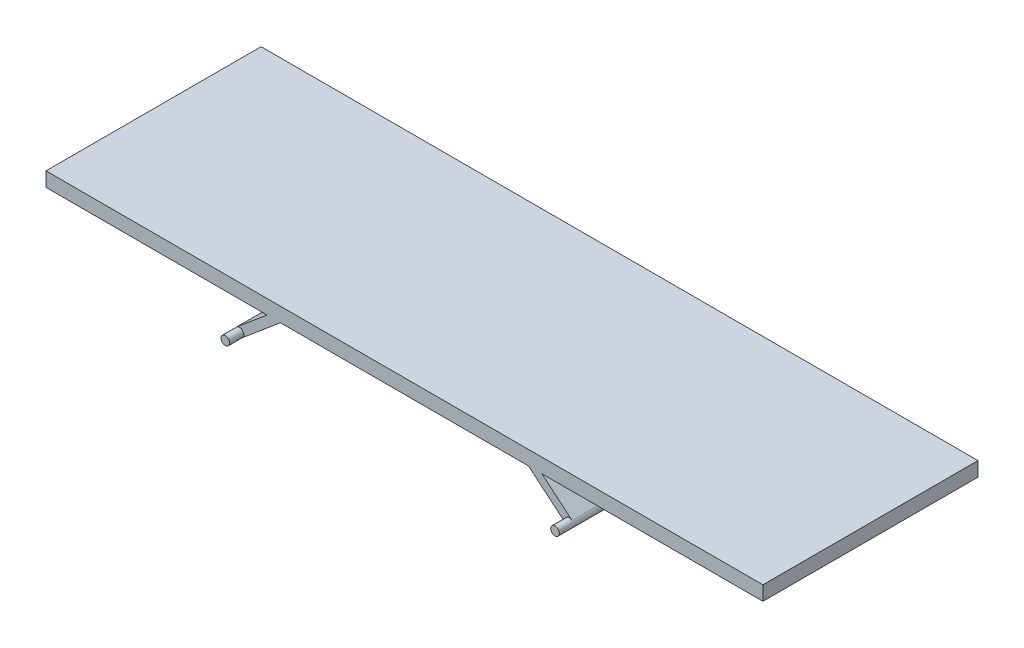
ISO-10303-21;
HEADER;
FILE_DESCRIPTION(('STEP AP214'),'2;1');
FILE_NAME('part.step','',(''),(''),'','','');
FILE_SCHEMA(('AUTOMOTIVE_DESIGN { 1 0 10303 214 1 1 1 1 }'));
ENDSEC;
DATA;
#1=APPLICATION_CONTEXT('core data for automotive mechanical design processes');
#2=APPLICATION_PROTOCOL_DEFINITION('international standard','automotive_design',2000,#1);
#3=PRODUCT_CONTEXT('',#1,'mechanical');
#4=PRODUCT('Part','Part','',(#3));
#5=PRODUCT_RELATED_PRODUCT_CATEGORY('part','',(#4));
#6=PRODUCT_DEFINITION_FORMATION('','',#4);
#7=PRODUCT_DEFINITION_CONTEXT('part definition',#1,'design');
#8=PRODUCT_DEFINITION('design','',#6,#7);
#9=PRODUCT_DEFINITION_SHAPE('','',#8);
#10=(LENGTH_UNIT() NAMED_UNIT(*) SI_UNIT(.MILLI.,.METRE.));
#11=(NAMED_UNIT(*) PLANE_ANGLE_UNIT() SI_UNIT($,.RADIAN.));
#12=(NAMED_UNIT(*) SI_UNIT($,.STERADIAN.) SOLID_ANGLE_UNIT());
#13=UNCERTAINTY_MEASURE_WITH_UNIT(LENGTH_MEASURE(1.E-05),#10,'distance_accuracy_value','');
#14=(GEOMETRIC_REPRESENTATION_CONTEXT(3) GLOBAL_UNCERTAINTY_ASSIGNED_CONTEXT((#13)) GLOBAL_UNIT_ASSIGNED_CONTEXT((#10,
#11,#12)) REPRESENTATION_CONTEXT('',''));
#15=CARTESIAN_POINT('',(0.,0.,0.));
#16=DIRECTION('',(0.,0.,1.));
#17=DIRECTION('',(1.,0.,0.));
#18=AXIS2_PLACEMENT_3D('',#15,#16,#17);
#19=CARTESIAN_POINT('',(230.,-50.,300.));
#20=DIRECTION('',(0.,0.,1.));
#21=DIRECTION('',(1.,0.,0.));
#22=AXIS2_PLACEMENT_3D('',#19,#20,#21);
#23=PLANE('',#22);
#24=DIRECTION('',(0.766044443118977,-0.64278760968654,0.));
#25=VECTOR('',#24,1.);
#26=CARTESIAN_POINT('',(226.143274341881,-54.5962666587139,300.));
#27=LINE('',#26,#25);
#28=CARTESIAN_POINT('',(172.995513335069,-9.99999999999998,300.));
#29=VERTEX_POINT('',#28);
#30=CARTESIAN_POINT('',(226.143274341881,-54.5962666587139,300.));
#31=VERTEX_POINT('',#30);
#32=EDGE_CURVE('E268',#29,#31,#27,.T.);
#33=ORIENTED_EDGE('',*,*,#32,.T.);
#34=CARTESIAN_POINT('',(230.,-50.,300.));
#35=DIRECTION('',(0.,0.,1.));
#36=DIRECTION('',(1.,0.,0.));
#37=AXIS2_PLACEMENT_3D('',#34,#35,#36);
#38=CIRCLE('',#37,6.00000000000002);
#39=CARTESIAN_POINT('',(233.856725658119,-45.4037333412861,300.));
#40=VERTEX_POINT('',#39);
#41=EDGE_CURVE('E274',#40,#31,#38,.T.);
#42=ORIENTED_EDGE('',*,*,#41,.F.);
#43=DIRECTION('',(-0.766044443118977,0.64278760968654,0.));
#44=VECTOR('',#43,1.);
#45=CARTESIAN_POINT('',(233.856725658119,-45.4037333412861,300.));
#46=LINE('',#45,#44);
#47=CARTESIAN_POINT('',(191.664199257394,-9.99999999999997,300.));
#48=VERTEX_POINT('',#47);
#49=EDGE_CURVE('E142',#40,#48,#46,.T.);
#50=ORIENTED_EDGE('',*,*,#49,.T.);
#51=DIRECTION('',(1.,0.,0.));
#52=VECTOR('',#51,1.);
#53=CARTESIAN_POINT('',(500.,-9.99999999999994,300.));
#54=LINE('',#53,#52);
#55=CARTESIAN_POINT('',(500.,-9.99999999999994,300.));
#56=VERTEX_POINT('',#55);
#57=EDGE_CURVE('E136',#48,#56,#54,.T.);
#58=ORIENTED_EDGE('',*,*,#57,.T.);
#59=DIRECTION('',(0.,1.,0.));
#60=VECTOR('',#59,1.);
#61=CARTESIAN_POINT('',(500.,-9.99999999999994,300.));
#62=LINE('',#61,#60);
#63=CARTESIAN_POINT('',(500.,10.0000000000001,300.));
#64=VERTEX_POINT('',#63);
#65=EDGE_CURVE('E139',#56,#64,#62,.T.);
#66=ORIENTED_EDGE('',*,*,#65,.T.);
#67=DIRECTION('',(-1.,0.,0.));
#68=VECTOR('',#67,1.);
#69=CARTESIAN_POINT('',(500.,10.0000000000001,300.));
#70=LINE('',#69,#68);
#71=CARTESIAN_POINT('',(-500.,9.99999999999994,300.));
#72=VERTEX_POINT('',#71);
#73=EDGE_CURVE('E58',#64,#72,#70,.T.);
#74=ORIENTED_EDGE('',*,*,#73,.T.);
#75=DIRECTION('',(0.,-1.,0.));
#76=VECTOR('',#75,1.);
#77=CARTESIAN_POINT('',(-500.,-10.0000000000001,300.));
#78=LINE('',#77,#76);
#79=CARTESIAN_POINT('',(-500.,-10.0000000000001,300.));
#80=VERTEX_POINT('',#79);
#81=EDGE_CURVE('E199',#72,#80,#78,.T.);
#82=ORIENTED_EDGE('',*,*,#81,.T.);
#83=DIRECTION('',(1.,0.,0.));
#84=VECTOR('',#83,1.);
#85=CARTESIAN_POINT('',(-191.664199257394,-10.,300.));
#86=LINE('',#85,#84);
#87=CARTESIAN_POINT('',(-191.664199257394,-10.,300.));
#88=VERTEX_POINT('',#87);
#89=EDGE_CURVE('E115',#80,#88,#86,.T.);
#90=ORIENTED_EDGE('',*,*,#89,.T.);
#91=DIRECTION('',(-0.766044443118981,-0.642787609686535,0.));
#92=VECTOR('',#91,1.);
#93=CARTESIAN_POINT('',(-233.856725658119,-45.4037333412861,300.));
#94=LINE('',#93,#92);
#95=CARTESIAN_POINT('',(-233.856725658119,-45.4037333412861,300.));
#96=VERTEX_POINT('',#95);
#97=EDGE_CURVE('E256',#88,#96,#94,.T.);
#98=ORIENTED_EDGE('',*,*,#97,.T.);
#99=CARTESIAN_POINT('',(-230.,-50.,300.));
#100=DIRECTION('',(0.,0.,1.));
#101=DIRECTION('',(1.,0.,0.));
#102=AXIS2_PLACEMENT_3D('',#99,#100,#101);
#103=CIRCLE('',#102,5.99999999999999);
#104=CARTESIAN_POINT('',(-226.143274341881,-54.5962666587139,300.));
#105=VERTEX_POINT('',#104);
#106=EDGE_CURVE('E11',#105,#96,#103,.T.);
#107=ORIENTED_EDGE('',*,*,#106,.F.);
#108=DIRECTION('',(0.766044443118981,0.642787609686535,0.));
#109=VECTOR('',#108,1.);
#110=CARTESIAN_POINT('',(-226.143274341881,-54.5962666587139,300.));
#111=LINE('',#110,#109);
#112=CARTESIAN_POINT('',(-172.995513335069,-10.,300.));
#113=VERTEX_POINT('',#112);
#114=EDGE_CURVE('E254',#105,#113,#111,.T.);
#115=ORIENTED_EDGE('',*,*,#114,.T.);
#116=DIRECTION('',(1.,0.,0.));
#117=VECTOR('',#116,1.);
#118=CARTESIAN_POINT('',(172.995513335069,-9.99999999999998,300.));
#119=LINE('',#118,#117);
#120=EDGE_CURVE('E261',#113,#29,#119,.T.);
#121=ORIENTED_EDGE('',*,*,#120,.T.);
#122=EDGE_LOOP('',(#33,#42,#50,#58,#66,#74,#82,#90,#98,#107,#115,#121));
#123=FACE_BOUND('',#122,.T.);
#124=ADVANCED_FACE('F39',(#123),#23,.T.);
#125=CARTESIAN_POINT('',(-500.,-10.0000000000001,300.));
#126=DIRECTION('',(1.,0.,0.));
#127=DIRECTION('',(0.,0.,-1.));
#128=AXIS2_PLACEMENT_3D('',#125,#126,#127);
#129=PLANE('',#128);
#130=DIRECTION('',(0.,-1.,0.));
#131=VECTOR('',#130,1.);
#132=CARTESIAN_POINT('',(-500.,-10.0000000000001,0.));
#133=LINE('',#132,#131);
#134=CARTESIAN_POINT('',(-500.,9.99999999999994,0.));
#135=VERTEX_POINT('',#134);
#136=CARTESIAN_POINT('',(-500.,-10.0000000000001,0.));
#137=VERTEX_POINT('',#136);
#138=EDGE_CURVE('E164',#135,#137,#133,.T.);
#139=ORIENTED_EDGE('',*,*,#138,.T.);
#140=DIRECTION('',(0.,0.,-1.));
#141=VECTOR('',#140,1.);
#142=CARTESIAN_POINT('',(-500.,-10.0000000000001,300.));
#143=LINE('',#142,#141);
#144=EDGE_CURVE('E43',#80,#137,#143,.T.);
#145=ORIENTED_EDGE('',*,*,#144,.F.);
#146=ORIENTED_EDGE('',*,*,#81,.F.);
#147=DIRECTION('',(0.,0.,-1.));
#148=VECTOR('',#147,1.);
#149=CARTESIAN_POINT('',(-500.,9.99999999999994,300.));
#150=LINE('',#149,#148);
#151=EDGE_CURVE('E160',#72,#135,#150,.T.);
#152=ORIENTED_EDGE('',*,*,#151,.T.);
#153=EDGE_LOOP('',(#139,#145,#146,#152));
#154=FACE_BOUND('',#153,.T.);
#155=ADVANCED_FACE('F41',(#154),#129,.F.);
#156=CARTESIAN_POINT('',(-191.664199257394,-10.,300.));
#157=DIRECTION('',(0.,1.,0.));
#158=DIRECTION('',(-1.,0.,0.));
#159=AXIS2_PLACEMENT_3D('',#156,#157,#158);
#160=PLANE('',#159);
#161=DIRECTION('',(1.,0.,0.));
#162=VECTOR('',#161,1.);
#163=CARTESIAN_POINT('',(-191.664199257394,-10.,0.));
#164=LINE('',#163,#162);
#165=CARTESIAN_POINT('',(-191.664199257394,-10.,0.));
#166=VERTEX_POINT('',#165);
#167=EDGE_CURVE('E168',#137,#166,#164,.T.);
#168=ORIENTED_EDGE('',*,*,#167,.T.);
#169=DIRECTION('',(0.,0.,-1.));
#170=VECTOR('',#169,1.);
#171=CARTESIAN_POINT('',(-191.664199257394,-10.,300.));
#172=LINE('',#171,#170);
#173=EDGE_CURVE('E229',#88,#166,#172,.T.);
#174=ORIENTED_EDGE('',*,*,#173,.F.);
#175=ORIENTED_EDGE('',*,*,#89,.F.);
#176=ORIENTED_EDGE('',*,*,#144,.T.);
#177=EDGE_LOOP('',(#168,#174,#175,#176));
#178=FACE_BOUND('',#177,.T.);
#179=ADVANCED_FACE('F237',(#178),#160,.F.);
#180=CARTESIAN_POINT('',(-233.856725658119,-45.4037333412861,300.));
#181=DIRECTION('',(0.642787609686535,-0.766044443118981,0.));
#182=DIRECTION('',(0.766044443118981,0.642787609686535,0.));
#183=AXIS2_PLACEMENT_3D('',#180,#181,#182);
#184=PLANE('',#183);
#185=DIRECTION('',(-0.766044443118981,-0.642787609686535,0.));
#186=VECTOR('',#185,1.);
#187=CARTESIAN_POINT('',(-233.856725658119,-45.4037333412861,0.));
#188=LINE('',#187,#186);
#189=CARTESIAN_POINT('',(-233.856725658119,-45.4037333412861,0.));
#190=VERTEX_POINT('',#189);
#191=EDGE_CURVE('E172',#166,#190,#188,.T.);
#192=ORIENTED_EDGE('',*,*,#191,.T.);
#193=DIRECTION('',(0.,0.,-1.));
#194=VECTOR('',#193,1.);
#195=CARTESIAN_POINT('',(-233.856725658119,-45.4037333412861,300.));
#196=LINE('',#195,#194);
#197=EDGE_CURVE('E226',#96,#190,#196,.T.);
#198=ORIENTED_EDGE('',*,*,#197,.F.);
#199=ORIENTED_EDGE('',*,*,#97,.F.);
#200=ORIENTED_EDGE('',*,*,#173,.T.);
#201=EDGE_LOOP('',(#192,#198,#199,#200));
#202=FACE_BOUND('',#201,.T.);
#203=ADVANCED_FACE('F246',(#202),#184,.F.);
#204=CARTESIAN_POINT('',(-230.,-50.,300.));
#205=DIRECTION('',(0.,0.,-1.));
#206=DIRECTION('',(-1.,0.,0.));
#207=AXIS2_PLACEMENT_3D('',#204,#205,#206);
#208=CYLINDRICAL_SURFACE('',#207,5.99999999999999);
#209=CARTESIAN_POINT('',(-230.,-50.,0.));
#210=DIRECTION('',(0.,0.,1.));
#211=DIRECTION('',(1.,0.,0.));
#212=AXIS2_PLACEMENT_3D('',#209,#210,#211);
#213=CIRCLE('',#212,5.99999999999999);
#214=CARTESIAN_POINT('',(-226.143274341881,-54.5962666587139,0.));
#215=VERTEX_POINT('',#214);
#216=EDGE_CURVE('E175',#190,#215,#213,.T.);
#217=ORIENTED_EDGE('',*,*,#216,.T.);
#218=DIRECTION('',(0.,0.,-1.));
#219=VECTOR('',#218,1.);
#220=CARTESIAN_POINT('',(-226.143274341881,-54.5962666587139,300.));
#221=LINE('',#220,#219);
#222=EDGE_CURVE('E222',#105,#215,#221,.T.);
#223=ORIENTED_EDGE('',*,*,#222,.F.);
#224=ORIENTED_EDGE('',*,*,#106,.T.);
#225=ORIENTED_EDGE('',*,*,#197,.T.);
#226=EDGE_LOOP('',(#217,#223,#224,#225));
#227=FACE_BOUND('',#226,.T.);
#228=CARTESIAN_POINT('',(-230.,-50.,320.));
#229=DIRECTION('',(0.,0.,1.));
#230=DIRECTION('',(1.,0.,0.));
#231=AXIS2_PLACEMENT_3D('',#228,#229,#230);
#232=CIRCLE('',#231,5.99999999999999);
#233=CARTESIAN_POINT('',(-224.,-50.,320.));
#234=VERTEX_POINT('',#233);
#235=EDGE_CURVE('E169',#234,#234,#232,.T.);
#236=ORIENTED_EDGE('',*,*,#235,.F.);
#237=EDGE_LOOP('',(#236));
#238=FACE_BOUND('',#237,.T.);
#239=ADVANCED_FACE('F249',(#227,#238),#208,.T.);
#240=CARTESIAN_POINT('',(-226.143274341881,-54.5962666587139,300.));
#241=DIRECTION('',(-0.642787609686535,0.766044443118981,0.));
#242=DIRECTION('',(-0.766044443118981,-0.642787609686535,0.));
#243=AXIS2_PLACEMENT_3D('',#240,#241,#242);
#244=PLANE('',#243);
#245=DIRECTION('',(0.766044443118981,0.642787609686535,0.));
#246=VECTOR('',#245,1.);
#247=CARTESIAN_POINT('',(-226.143274341881,-54.5962666587139,0.));
#248=LINE('',#247,#246);
#249=CARTESIAN_POINT('',(-172.995513335069,-10.,0.));
#250=VERTEX_POINT('',#249);
#251=EDGE_CURVE('E178',#215,#250,#248,.T.);
#252=ORIENTED_EDGE('',*,*,#251,.T.);
#253=DIRECTION('',(0.,0.,-1.));
#254=VECTOR('',#253,1.);
#255=CARTESIAN_POINT('',(-172.995513335069,-10.,300.));
#256=LINE('',#255,#254);
#257=EDGE_CURVE('E218',#113,#250,#256,.T.);
#258=ORIENTED_EDGE('',*,*,#257,.F.);
#259=ORIENTED_EDGE('',*,*,#114,.F.);
#260=ORIENTED_EDGE('',*,*,#222,.T.);
#261=EDGE_LOOP('',(#252,#258,#259,#260));
#262=FACE_BOUND('',#261,.T.);
#263=ADVANCED_FACE('F299',(#262),#244,.F.);
#264=CARTESIAN_POINT('',(172.995513335069,-9.99999999999998,300.));
#265=DIRECTION('',(0.,1.,0.));
#266=DIRECTION('',(-1.,0.,0.));
#267=AXIS2_PLACEMENT_3D('',#264,#265,#266);
#268=PLANE('',#267);
#269=DIRECTION('',(1.,0.,0.));
#270=VECTOR('',#269,1.);
#271=CARTESIAN_POINT('',(172.995513335069,-9.99999999999998,0.));
#272=LINE('',#271,#270);
#273=CARTESIAN_POINT('',(172.995513335069,-9.99999999999998,0.));
#274=VERTEX_POINT('',#273);
#275=EDGE_CURVE('E181',#250,#274,#272,.T.);
#276=ORIENTED_EDGE('',*,*,#275,.T.);
#277=DIRECTION('',(0.,0.,-1.));
#278=VECTOR('',#277,1.);
#279=CARTESIAN_POINT('',(172.995513335069,-9.99999999999998,300.));
#280=LINE('',#279,#278);
#281=EDGE_CURVE('E214',#29,#274,#280,.T.);
#282=ORIENTED_EDGE('',*,*,#281,.F.);
#283=ORIENTED_EDGE('',*,*,#120,.F.);
#284=ORIENTED_EDGE('',*,*,#257,.T.);
#285=EDGE_LOOP('',(#276,#282,#283,#284));
#286=FACE_BOUND('',#285,.T.);
#287=ADVANCED_FACE('F305',(#286),#268,.F.);
#288=CARTESIAN_POINT('',(226.143274341881,-54.5962666587139,300.));
#289=DIRECTION('',(0.64278760968654,0.766044443118977,0.));
#290=DIRECTION('',(-0.766044443118977,0.64278760968654,0.));
#291=AXIS2_PLACEMENT_3D('',#288,#289,#290);
#292=PLANE('',#291);
#293=DIRECTION('',(0.766044443118977,-0.64278760968654,0.));
#294=VECTOR('',#293,1.);
#295=CARTESIAN_POINT('',(226.143274341881,-54.5962666587139,0.));
#296=LINE('',#295,#294);
#297=CARTESIAN_POINT('',(226.143274341881,-54.5962666587139,0.));
#298=VERTEX_POINT('',#297);
#299=EDGE_CURVE('E184',#274,#298,#296,.T.);
#300=ORIENTED_EDGE('',*,*,#299,.T.);
#301=DIRECTION('',(0.,0.,-1.));
#302=VECTOR('',#301,1.);
#303=CARTESIAN_POINT('',(226.143274341881,-54.5962666587139,300.));
#304=LINE('',#303,#302);
#305=EDGE_CURVE('E210',#31,#298,#304,.T.);
#306=ORIENTED_EDGE('',*,*,#305,.F.);
#307=ORIENTED_EDGE('',*,*,#32,.F.);
#308=ORIENTED_EDGE('',*,*,#281,.T.);
#309=EDGE_LOOP('',(#300,#306,#307,#308));
#310=FACE_BOUND('',#309,.T.);
#311=ADVANCED_FACE('F278',(#310),#292,.F.);
#312=CARTESIAN_POINT('',(230.,-50.,300.));
#313=DIRECTION('',(0.,0.,-1.));
#314=DIRECTION('',(-1.,0.,0.));
#315=AXIS2_PLACEMENT_3D('',#312,#313,#314);
#316=CYLINDRICAL_SURFACE('',#315,6.00000000000002);
#317=CARTESIAN_POINT('',(230.,-50.,0.));
#318=DIRECTION('',(0.,0.,1.));
#319=DIRECTION('',(1.,0.,0.));
#320=AXIS2_PLACEMENT_3D('',#317,#318,#319);
#321=CIRCLE('',#320,6.00000000000002);
#322=CARTESIAN_POINT('',(233.856725658119,-45.4037333412861,0.));
#323=VERTEX_POINT('',#322);
#324=EDGE_CURVE('E187',#298,#323,#321,.T.);
#325=ORIENTED_EDGE('',*,*,#324,.T.);
#326=DIRECTION('',(0.,0.,-1.));
#327=VECTOR('',#326,1.);
#328=CARTESIAN_POINT('',(233.856725658119,-45.4037333412861,300.));
#329=LINE('',#328,#327);
#330=EDGE_CURVE('E206',#40,#323,#329,.T.);
#331=ORIENTED_EDGE('',*,*,#330,.F.);
#332=ORIENTED_EDGE('',*,*,#41,.T.);
#333=ORIENTED_EDGE('',*,*,#305,.T.);
#334=EDGE_LOOP('',(#325,#331,#332,#333));
#335=FACE_BOUND('',#334,.T.);
#336=CARTESIAN_POINT('',(230.,-50.,320.));
#337=DIRECTION('',(0.,0.,1.));
#338=DIRECTION('',(1.,0.,0.));
#339=AXIS2_PLACEMENT_3D('',#336,#337,#338);
#340=CIRCLE('',#339,6.00000000000002);
#341=CARTESIAN_POINT('',(236.,-50.,320.));
#342=VERTEX_POINT('',#341);
#343=EDGE_CURVE('E286',#342,#342,#340,.T.);
#344=ORIENTED_EDGE('',*,*,#343,.F.);
#345=EDGE_LOOP('',(#344));
#346=FACE_BOUND('',#345,.T.);
#347=ADVANCED_FACE('F283',(#335,#346),#316,.T.);
#348=CARTESIAN_POINT('',(233.856725658119,-45.4037333412861,300.));
#349=DIRECTION('',(-0.64278760968654,-0.766044443118977,0.));
#350=DIRECTION('',(0.766044443118977,-0.64278760968654,0.));
#351=AXIS2_PLACEMENT_3D('',#348,#349,#350);
#352=PLANE('',#351);
#353=DIRECTION('',(-0.766044443118977,0.64278760968654,0.));
#354=VECTOR('',#353,1.);
#355=CARTESIAN_POINT('',(233.856725658119,-45.4037333412861,0.));
#356=LINE('',#355,#354);
#357=CARTESIAN_POINT('',(191.664199257394,-9.99999999999997,0.));
#358=VERTEX_POINT('',#357);
#359=EDGE_CURVE('E190',#323,#358,#356,.T.);
#360=ORIENTED_EDGE('',*,*,#359,.T.);
#361=DIRECTION('',(0.,0.,-1.));
#362=VECTOR('',#361,1.);
#363=CARTESIAN_POINT('',(191.664199257394,-9.99999999999997,300.));
#364=LINE('',#363,#362);
#365=EDGE_CURVE('E153',#48,#358,#364,.T.);
#366=ORIENTED_EDGE('',*,*,#365,.F.);
#367=ORIENTED_EDGE('',*,*,#49,.F.);
#368=ORIENTED_EDGE('',*,*,#330,.T.);
#369=EDGE_LOOP('',(#360,#366,#367,#368));
#370=FACE_BOUND('',#369,.T.);
#371=ADVANCED_FACE('F326',(#370),#352,.F.);
#372=CARTESIAN_POINT('',(500.,-9.99999999999994,300.));
#373=DIRECTION('',(0.,1.,0.));
#374=DIRECTION('',(-1.,0.,0.));
#375=AXIS2_PLACEMENT_3D('',#372,#373,#374);
#376=PLANE('',#375);
#377=DIRECTION('',(1.,0.,0.));
#378=VECTOR('',#377,1.);
#379=CARTESIAN_POINT('',(500.,-9.99999999999994,0.));
#380=LINE('',#379,#378);
#381=CARTESIAN_POINT('',(500.,-9.99999999999994,0.));
#382=VERTEX_POINT('',#381);
#383=EDGE_CURVE('E151',#358,#382,#380,.T.);
#384=ORIENTED_EDGE('',*,*,#383,.T.);
#385=DIRECTION('',(0.,0.,-1.));
#386=VECTOR('',#385,1.);
#387=CARTESIAN_POINT('',(500.,-9.99999999999994,300.));
#388=LINE('',#387,#386);
#389=EDGE_CURVE('E148',#56,#382,#388,.T.);
#390=ORIENTED_EDGE('',*,*,#389,.F.);
#391=ORIENTED_EDGE('',*,*,#57,.F.);
#392=ORIENTED_EDGE('',*,*,#365,.T.);
#393=EDGE_LOOP('',(#384,#390,#391,#392));
#394=FACE_BOUND('',#393,.T.);
#395=ADVANCED_FACE('F149',(#394),#376,.F.);
#396=CARTESIAN_POINT('',(500.,-9.99999999999994,300.));
#397=DIRECTION('',(-1.,0.,0.));
#398=DIRECTION('',(0.,0.,1.));
#399=AXIS2_PLACEMENT_3D('',#396,#397,#398);
#400=PLANE('',#399);
#401=DIRECTION('',(0.,1.,0.));
#402=VECTOR('',#401,1.);
#403=CARTESIAN_POINT('',(500.,-9.99999999999994,0.));
#404=LINE('',#403,#402);
#405=CARTESIAN_POINT('',(500.,10.0000000000001,0.));
#406=VERTEX_POINT('',#405);
#407=EDGE_CURVE('E100',#382,#406,#404,.T.);
#408=ORIENTED_EDGE('',*,*,#407,.T.);
#409=DIRECTION('',(0.,0.,-1.));
#410=VECTOR('',#409,1.);
#411=CARTESIAN_POINT('',(500.,10.0000000000001,300.));
#412=LINE('',#411,#410);
#413=EDGE_CURVE('E154',#64,#406,#412,.T.);
#414=ORIENTED_EDGE('',*,*,#413,.F.);
#415=ORIENTED_EDGE('',*,*,#65,.F.);
#416=ORIENTED_EDGE('',*,*,#389,.T.);
#417=EDGE_LOOP('',(#408,#414,#415,#416));
#418=FACE_BOUND('',#417,.T.);
#419=ADVANCED_FACE('F156',(#418),#400,.F.);
#420=CARTESIAN_POINT('',(500.,10.0000000000001,300.));
#421=DIRECTION('',(0.,-1.,0.));
#422=DIRECTION('',(1.,0.,0.));
#423=AXIS2_PLACEMENT_3D('',#420,#421,#422);
#424=PLANE('',#423);
#425=DIRECTION('',(-1.,0.,0.));
#426=VECTOR('',#425,1.);
#427=CARTESIAN_POINT('',(500.,10.0000000000001,0.));
#428=LINE('',#427,#426);
#429=EDGE_CURVE('E106',#406,#135,#428,.T.);
#430=ORIENTED_EDGE('',*,*,#429,.T.);
#431=ORIENTED_EDGE('',*,*,#151,.F.);
#432=ORIENTED_EDGE('',*,*,#73,.F.);
#433=ORIENTED_EDGE('',*,*,#413,.T.);
#434=EDGE_LOOP('',(#430,#431,#432,#433));
#435=FACE_BOUND('',#434,.T.);
#436=ADVANCED_FACE('F319',(#435),#424,.F.);
#437=CARTESIAN_POINT('',(230.,-50.,0.));
#438=DIRECTION('',(0.,0.,1.));
#439=DIRECTION('',(1.,0.,0.));
#440=AXIS2_PLACEMENT_3D('',#437,#438,#439);
#441=PLANE('',#440);
#442=ORIENTED_EDGE('',*,*,#138,.F.);
#443=ORIENTED_EDGE('',*,*,#429,.F.);
#444=ORIENTED_EDGE('',*,*,#407,.F.);
#445=ORIENTED_EDGE('',*,*,#383,.F.);
#446=ORIENTED_EDGE('',*,*,#359,.F.);
#447=ORIENTED_EDGE('',*,*,#324,.F.);
#448=ORIENTED_EDGE('',*,*,#299,.F.);
#449=ORIENTED_EDGE('',*,*,#275,.F.);
#450=ORIENTED_EDGE('',*,*,#251,.F.);
#451=ORIENTED_EDGE('',*,*,#216,.F.);
#452=ORIENTED_EDGE('',*,*,#191,.F.);
#453=ORIENTED_EDGE('',*,*,#167,.F.);
#454=EDGE_LOOP('',(#442,#443,#444,#445,#446,#447,#448,#449,#450,#451,#452,#453));
#455=FACE_BOUND('',#454,.T.);
#456=ADVANCED_FACE('F242',(#455),#441,.F.);
#457=CARTESIAN_POINT('',(-230.,-50.,320.));
#458=DIRECTION('',(0.,0.,1.));
#459=DIRECTION('',(1.,0.,0.));
#460=AXIS2_PLACEMENT_3D('',#457,#458,#459);
#461=PLANE('',#460);
#462=ORIENTED_EDGE('',*,*,#235,.T.);
#463=EDGE_LOOP('',(#462));
#464=FACE_BOUND('',#463,.T.);
#465=ADVANCED_FACE('F297',(#464),#461,.T.);
#466=CARTESIAN_POINT('',(230.,-50.,320.));
#467=DIRECTION('',(0.,0.,1.));
#468=DIRECTION('',(1.,0.,0.));
#469=AXIS2_PLACEMENT_3D('',#466,#467,#468);
#470=PLANE('',#469);
#471=ORIENTED_EDGE('',*,*,#343,.T.);
#472=EDGE_LOOP('',(#471));
#473=FACE_BOUND('',#472,.T.);
#474=ADVANCED_FACE('F377',(#473),#470,.T.);
#475=CLOSED_SHELL('',(#124,#155,#179,#203,#239,#263,#287,#311,#347,#371,#395,#419,#436,#456,
#465,#474));
#476=MANIFOLD_SOLID_BREP('B2',#475);
#477=ADVANCED_BREP_SHAPE_REPRESENTATION('',(#18,#476),#14);
#478=SHAPE_DEFINITION_REPRESENTATION(#9,#477);
ENDSEC;
END-ISO-10303-21;
